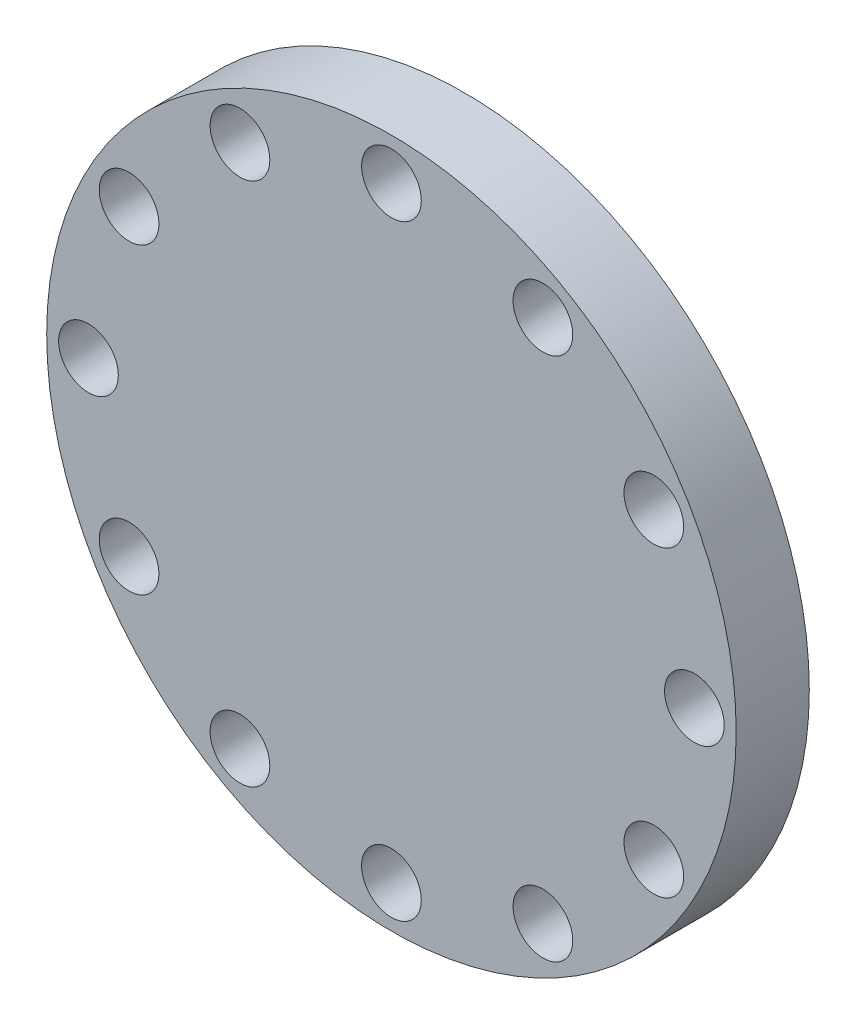
ISO-10303-21;
HEADER;
FILE_DESCRIPTION(('STEP AP214'),'2;1');
FILE_NAME('part.step','',(''),(''),'','','');
FILE_SCHEMA(('AUTOMOTIVE_DESIGN { 1 0 10303 214 1 1 1 1 }'));
ENDSEC;
DATA;
#1=APPLICATION_CONTEXT('core data for automotive mechanical design processes');
#2=APPLICATION_PROTOCOL_DEFINITION('international standard','automotive_design',2000,#1);
#3=PRODUCT_CONTEXT('',#1,'mechanical');
#4=PRODUCT('Part','Part','',(#3));
#5=PRODUCT_RELATED_PRODUCT_CATEGORY('part','',(#4));
#6=PRODUCT_DEFINITION_FORMATION('','',#4);
#7=PRODUCT_DEFINITION_CONTEXT('part definition',#1,'design');
#8=PRODUCT_DEFINITION('design','',#6,#7);
#9=PRODUCT_DEFINITION_SHAPE('','',#8);
#10=(LENGTH_UNIT() NAMED_UNIT(*) SI_UNIT(.MILLI.,.METRE.));
#11=(NAMED_UNIT(*) PLANE_ANGLE_UNIT() SI_UNIT($,.RADIAN.));
#12=(NAMED_UNIT(*) SI_UNIT($,.STERADIAN.) SOLID_ANGLE_UNIT());
#13=UNCERTAINTY_MEASURE_WITH_UNIT(LENGTH_MEASURE(1.E-05),#10,'distance_accuracy_value','');
#14=(GEOMETRIC_REPRESENTATION_CONTEXT(3) GLOBAL_UNCERTAINTY_ASSIGNED_CONTEXT((#13)) GLOBAL_UNIT_ASSIGNED_CONTEXT((#10,
#11,#12)) REPRESENTATION_CONTEXT('',''));
#15=CARTESIAN_POINT('',(0.,0.,0.));
#16=DIRECTION('',(0.,0.,1.));
#17=DIRECTION('',(1.,0.,0.));
#18=AXIS2_PLACEMENT_3D('',#15,#16,#17);
#19=CARTESIAN_POINT('',(0.,0.,70.));
#20=DIRECTION('',(0.,0.,-1.));
#21=DIRECTION('',(-1.,0.,0.));
#22=AXIS2_PLACEMENT_3D('',#19,#20,#21);
#23=CYLINDRICAL_SURFACE('',#22,330.);
#24=CARTESIAN_POINT('',(0.,0.,70.));
#25=DIRECTION('',(0.,0.,1.));
#26=DIRECTION('',(1.,0.,0.));
#27=AXIS2_PLACEMENT_3D('',#24,#25,#26);
#28=CIRCLE('',#27,330.);
#29=CARTESIAN_POINT('',(330.,0.,70.));
#30=VERTEX_POINT('',#29);
#31=EDGE_CURVE('E11',#30,#30,#28,.T.);
#32=ORIENTED_EDGE('',*,*,#31,.F.);
#33=EDGE_LOOP('',(#32));
#34=FACE_BOUND('',#33,.T.);
#35=CARTESIAN_POINT('',(0.,0.,0.));
#36=DIRECTION('',(0.,0.,1.));
#37=DIRECTION('',(1.,0.,0.));
#38=AXIS2_PLACEMENT_3D('',#35,#36,#37);
#39=CIRCLE('',#38,330.);
#40=CARTESIAN_POINT('',(330.,0.,0.));
#41=VERTEX_POINT('',#40);
#42=EDGE_CURVE('E43',#41,#41,#39,.T.);
#43=ORIENTED_EDGE('',*,*,#42,.T.);
#44=EDGE_LOOP('',(#43));
#45=FACE_BOUND('',#44,.T.);
#46=ADVANCED_FACE('F40',(#34,#45),#23,.T.);
#47=CARTESIAN_POINT('',(0.,0.,70.));
#48=DIRECTION('',(0.,0.,1.));
#49=DIRECTION('',(1.,0.,0.));
#50=AXIS2_PLACEMENT_3D('',#47,#48,#49);
#51=PLANE('',#50);
#52=CARTESIAN_POINT('',(251.147367097493,145.000000000011,70.));
#53=DIRECTION('',(0.,0.,1.));
#54=DIRECTION('',(1.,0.,0.));
#55=AXIS2_PLACEMENT_3D('',#52,#53,#54);
#56=CIRCLE('',#55,28.5750000000034);
#57=CARTESIAN_POINT('',(279.722367097497,145.000000000011,70.));
#58=VERTEX_POINT('',#57);
#59=EDGE_CURVE('E57',#58,#58,#56,.F.);
#60=ORIENTED_EDGE('',*,*,#59,.T.);
#61=EDGE_LOOP('',(#60));
#62=FACE_BOUND('',#61,.T.);
#63=CARTESIAN_POINT('',(145.,251.147367097487,70.));
#64=DIRECTION('',(0.,0.,1.));
#65=DIRECTION('',(1.,0.,0.));
#66=AXIS2_PLACEMENT_3D('',#63,#64,#65);
#67=CIRCLE('',#66,28.575);
#68=CARTESIAN_POINT('',(173.575,251.147367097487,70.));
#69=VERTEX_POINT('',#68);
#70=EDGE_CURVE('E60',#69,#69,#67,.F.);
#71=ORIENTED_EDGE('',*,*,#70,.T.);
#72=EDGE_LOOP('',(#71));
#73=FACE_BOUND('',#72,.T.);
#74=CARTESIAN_POINT('',(0.,290.,70.));
#75=DIRECTION('',(0.,0.,1.));
#76=DIRECTION('',(1.,0.,0.));
#77=AXIS2_PLACEMENT_3D('',#74,#75,#76);
#78=CIRCLE('',#77,28.575);
#79=CARTESIAN_POINT('',(28.575,290.,70.));
#80=VERTEX_POINT('',#79);
#81=EDGE_CURVE('E63',#80,#80,#78,.F.);
#82=ORIENTED_EDGE('',*,*,#81,.T.);
#83=EDGE_LOOP('',(#82));
#84=FACE_BOUND('',#83,.T.);
#85=CARTESIAN_POINT('',(-144.999999999998,251.147367097481,70.));
#86=DIRECTION('',(0.,0.,1.));
#87=DIRECTION('',(1.,0.,0.));
#88=AXIS2_PLACEMENT_3D('',#85,#86,#87);
#89=CIRCLE('',#88,28.5750000000072);
#90=CARTESIAN_POINT('',(-116.424999999991,251.147367097481,70.));
#91=VERTEX_POINT('',#90);
#92=EDGE_CURVE('E66',#91,#91,#89,.F.);
#93=ORIENTED_EDGE('',*,*,#92,.T.);
#94=EDGE_LOOP('',(#93));
#95=FACE_BOUND('',#94,.T.);
#96=CARTESIAN_POINT('',(-251.147367097481,144.999999999989,70.));
#97=DIRECTION('',(0.,0.,1.));
#98=DIRECTION('',(1.,0.,0.));
#99=AXIS2_PLACEMENT_3D('',#96,#97,#98);
#100=CIRCLE('',#99,28.5750000000125);
#101=CARTESIAN_POINT('',(-222.572367097469,144.999999999989,70.));
#102=VERTEX_POINT('',#101);
#103=EDGE_CURVE('E69',#102,#102,#100,.F.);
#104=ORIENTED_EDGE('',*,*,#103,.T.);
#105=EDGE_LOOP('',(#104));
#106=FACE_BOUND('',#105,.T.);
#107=CARTESIAN_POINT('',(145.000000000023,-251.147367097481,70.));
#108=DIRECTION('',(0.,0.,1.));
#109=DIRECTION('',(1.,0.,0.));
#110=AXIS2_PLACEMENT_3D('',#107,#108,#109);
#111=CIRCLE('',#110,28.5750000000219);
#112=CARTESIAN_POINT('',(173.575000000045,-251.147367097481,70.));
#113=VERTEX_POINT('',#112);
#114=EDGE_CURVE('E72',#113,#113,#111,.F.);
#115=ORIENTED_EDGE('',*,*,#114,.T.);
#116=EDGE_LOOP('',(#115));
#117=FACE_BOUND('',#116,.T.);
#118=CARTESIAN_POINT('',(-144.999999999977,-251.147367097493,70.));
#119=DIRECTION('',(0.,0.,1.));
#120=DIRECTION('',(1.,0.,0.));
#121=AXIS2_PLACEMENT_3D('',#118,#119,#120);
#122=CIRCLE('',#121,28.5750000000261);
#123=CARTESIAN_POINT('',(-116.424999999951,-251.147367097493,70.));
#124=VERTEX_POINT('',#123);
#125=EDGE_CURVE('E75',#124,#124,#122,.F.);
#126=ORIENTED_EDGE('',*,*,#125,.T.);
#127=EDGE_LOOP('',(#126));
#128=FACE_BOUND('',#127,.T.);
#129=CARTESIAN_POINT('',(251.147367097506,-144.999999999989,70.));
#130=DIRECTION('',(0.,0.,1.));
#131=DIRECTION('',(1.,0.,0.));
#132=AXIS2_PLACEMENT_3D('',#129,#130,#131);
#133=CIRCLE('',#132,28.5750000000159);
#134=CARTESIAN_POINT('',(279.722367097522,-144.999999999989,70.));
#135=VERTEX_POINT('',#134);
#136=EDGE_CURVE('E78',#135,#135,#133,.F.);
#137=ORIENTED_EDGE('',*,*,#136,.T.);
#138=EDGE_LOOP('',(#137));
#139=FACE_BOUND('',#138,.T.);
#140=CARTESIAN_POINT('',(2.46558576901009E-11,-290.,70.));
#141=DIRECTION('',(0.,0.,1.));
#142=DIRECTION('',(1.,0.,0.));
#143=AXIS2_PLACEMENT_3D('',#140,#141,#142);
#144=CIRCLE('',#143,28.5750000000255);
#145=CARTESIAN_POINT('',(28.5750000000502,-290.,70.));
#146=VERTEX_POINT('',#145);
#147=EDGE_CURVE('E81',#146,#146,#144,.F.);
#148=ORIENTED_EDGE('',*,*,#147,.T.);
#149=EDGE_LOOP('',(#148));
#150=FACE_BOUND('',#149,.T.);
#151=CARTESIAN_POINT('',(-251.147367097469,-145.000000000011,70.));
#152=DIRECTION('',(0.,0.,1.));
#153=DIRECTION('',(1.,0.,0.));
#154=AXIS2_PLACEMENT_3D('',#151,#152,#153);
#155=CIRCLE('',#154,28.5750000000236);
#156=CARTESIAN_POINT('',(-222.572367097445,-145.000000000011,70.));
#157=VERTEX_POINT('',#156);
#158=EDGE_CURVE('E84',#157,#157,#155,.F.);
#159=ORIENTED_EDGE('',*,*,#158,.T.);
#160=EDGE_LOOP('',(#159));
#161=FACE_BOUND('',#160,.T.);
#162=CARTESIAN_POINT('',(-289.999999999988,-1.23634436022257E-11,70.));
#163=DIRECTION('',(0.,0.,1.));
#164=DIRECTION('',(1.,0.,0.));
#165=AXIS2_PLACEMENT_3D('',#162,#163,#164);
#166=CIRCLE('',#165,28.5750000000184);
#167=CARTESIAN_POINT('',(-261.424999999969,-1.23634436022257E-11,70.));
#168=VERTEX_POINT('',#167);
#169=EDGE_CURVE('E87',#168,#168,#166,.F.);
#170=ORIENTED_EDGE('',*,*,#169,.T.);
#171=EDGE_LOOP('',(#170));
#172=FACE_BOUND('',#171,.T.);
#173=CARTESIAN_POINT('',(290.000000000012,1.23279288450505E-11,70.));
#174=DIRECTION('',(0.,0.,1.));
#175=DIRECTION('',(1.,0.,0.));
#176=AXIS2_PLACEMENT_3D('',#173,#174,#175);
#177=CIRCLE('',#176,28.5750000000092);
#178=CARTESIAN_POINT('',(318.575000000021,1.23279288450505E-11,70.));
#179=VERTEX_POINT('',#178);
#180=EDGE_CURVE('E50',#179,#179,#177,.F.);
#181=ORIENTED_EDGE('',*,*,#180,.T.);
#182=EDGE_LOOP('',(#181));
#183=FACE_BOUND('',#182,.T.);
#184=ORIENTED_EDGE('',*,*,#31,.T.);
#185=EDGE_LOOP('',(#184));
#186=FACE_BOUND('',#185,.T.);
#187=ADVANCED_FACE('F140',(#62,#73,#84,#95,#106,#117,#128,#139,#150,#161,#172,#183,#186),#51,.T.);
#188=CARTESIAN_POINT('',(0.,0.,0.));
#189=DIRECTION('',(0.,0.,1.));
#190=DIRECTION('',(1.,0.,0.));
#191=AXIS2_PLACEMENT_3D('',#188,#189,#190);
#192=PLANE('',#191);
#193=CARTESIAN_POINT('',(251.147367097493,145.000000000011,0.));
#194=DIRECTION('',(0.,0.,1.));
#195=DIRECTION('',(1.,0.,0.));
#196=AXIS2_PLACEMENT_3D('',#193,#194,#195);
#197=CIRCLE('',#196,28.5750000000034);
#198=CARTESIAN_POINT('',(279.722367097497,145.000000000011,0.));
#199=VERTEX_POINT('',#198);
#200=EDGE_CURVE('E90',#199,#199,#197,.T.);
#201=ORIENTED_EDGE('',*,*,#200,.T.);
#202=EDGE_LOOP('',(#201));
#203=FACE_BOUND('',#202,.T.);
#204=CARTESIAN_POINT('',(145.,251.147367097487,0.));
#205=DIRECTION('',(0.,0.,1.));
#206=DIRECTION('',(1.,0.,0.));
#207=AXIS2_PLACEMENT_3D('',#204,#205,#206);
#208=CIRCLE('',#207,28.575);
#209=CARTESIAN_POINT('',(173.575,251.147367097487,0.));
#210=VERTEX_POINT('',#209);
#211=EDGE_CURVE('E118',#210,#210,#208,.T.);
#212=ORIENTED_EDGE('',*,*,#211,.T.);
#213=EDGE_LOOP('',(#212));
#214=FACE_BOUND('',#213,.T.);
#215=CARTESIAN_POINT('',(0.,290.,0.));
#216=DIRECTION('',(0.,0.,1.));
#217=DIRECTION('',(1.,0.,0.));
#218=AXIS2_PLACEMENT_3D('',#215,#216,#217);
#219=CIRCLE('',#218,28.575);
#220=CARTESIAN_POINT('',(28.575,290.,0.));
#221=VERTEX_POINT('',#220);
#222=EDGE_CURVE('E115',#221,#221,#219,.T.);
#223=ORIENTED_EDGE('',*,*,#222,.T.);
#224=EDGE_LOOP('',(#223));
#225=FACE_BOUND('',#224,.T.);
#226=CARTESIAN_POINT('',(-144.999999999998,251.147367097481,0.));
#227=DIRECTION('',(0.,0.,1.));
#228=DIRECTION('',(1.,0.,0.));
#229=AXIS2_PLACEMENT_3D('',#226,#227,#228);
#230=CIRCLE('',#229,28.5750000000072);
#231=CARTESIAN_POINT('',(-116.424999999991,251.147367097481,0.));
#232=VERTEX_POINT('',#231);
#233=EDGE_CURVE('E112',#232,#232,#230,.T.);
#234=ORIENTED_EDGE('',*,*,#233,.T.);
#235=EDGE_LOOP('',(#234));
#236=FACE_BOUND('',#235,.T.);
#237=CARTESIAN_POINT('',(-251.147367097481,144.999999999989,0.));
#238=DIRECTION('',(0.,0.,1.));
#239=DIRECTION('',(1.,0.,0.));
#240=AXIS2_PLACEMENT_3D('',#237,#238,#239);
#241=CIRCLE('',#240,28.5750000000125);
#242=CARTESIAN_POINT('',(-222.572367097469,144.999999999989,0.));
#243=VERTEX_POINT('',#242);
#244=EDGE_CURVE('E101',#243,#243,#241,.T.);
#245=ORIENTED_EDGE('',*,*,#244,.T.);
#246=EDGE_LOOP('',(#245));
#247=FACE_BOUND('',#246,.T.);
#248=CARTESIAN_POINT('',(145.000000000023,-251.147367097481,0.));
#249=DIRECTION('',(0.,0.,1.));
#250=DIRECTION('',(1.,0.,0.));
#251=AXIS2_PLACEMENT_3D('',#248,#249,#250);
#252=CIRCLE('',#251,28.5750000000219);
#253=CARTESIAN_POINT('',(173.575000000045,-251.147367097481,0.));
#254=VERTEX_POINT('',#253);
#255=EDGE_CURVE('E102',#254,#254,#252,.T.);
#256=ORIENTED_EDGE('',*,*,#255,.T.);
#257=EDGE_LOOP('',(#256));
#258=FACE_BOUND('',#257,.T.);
#259=CARTESIAN_POINT('',(-144.999999999977,-251.147367097493,0.));
#260=DIRECTION('',(0.,0.,1.));
#261=DIRECTION('',(1.,0.,0.));
#262=AXIS2_PLACEMENT_3D('',#259,#260,#261);
#263=CIRCLE('',#262,28.5750000000261);
#264=CARTESIAN_POINT('',(-116.424999999951,-251.147367097493,0.));
#265=VERTEX_POINT('',#264);
#266=EDGE_CURVE('E105',#265,#265,#263,.T.);
#267=ORIENTED_EDGE('',*,*,#266,.T.);
#268=EDGE_LOOP('',(#267));
#269=FACE_BOUND('',#268,.T.);
#270=CARTESIAN_POINT('',(251.147367097506,-144.999999999989,0.));
#271=DIRECTION('',(0.,0.,1.));
#272=DIRECTION('',(1.,0.,0.));
#273=AXIS2_PLACEMENT_3D('',#270,#271,#272);
#274=CIRCLE('',#273,28.5750000000159);
#275=CARTESIAN_POINT('',(279.722367097522,-144.999999999989,0.));
#276=VERTEX_POINT('',#275);
#277=EDGE_CURVE('E95',#276,#276,#274,.T.);
#278=ORIENTED_EDGE('',*,*,#277,.T.);
#279=EDGE_LOOP('',(#278));
#280=FACE_BOUND('',#279,.T.);
#281=CARTESIAN_POINT('',(2.46558576901009E-11,-290.,0.));
#282=DIRECTION('',(0.,0.,1.));
#283=DIRECTION('',(1.,0.,0.));
#284=AXIS2_PLACEMENT_3D('',#281,#282,#283);
#285=CIRCLE('',#284,28.5750000000255);
#286=CARTESIAN_POINT('',(28.5750000000502,-290.,0.));
#287=VERTEX_POINT('',#286);
#288=EDGE_CURVE('E91',#287,#287,#285,.T.);
#289=ORIENTED_EDGE('',*,*,#288,.T.);
#290=EDGE_LOOP('',(#289));
#291=FACE_BOUND('',#290,.T.);
#292=CARTESIAN_POINT('',(-251.147367097469,-145.000000000011,0.));
#293=DIRECTION('',(0.,0.,1.));
#294=DIRECTION('',(1.,0.,0.));
#295=AXIS2_PLACEMENT_3D('',#292,#293,#294);
#296=CIRCLE('',#295,28.5750000000236);
#297=CARTESIAN_POINT('',(-222.572367097445,-145.000000000011,0.));
#298=VERTEX_POINT('',#297);
#299=EDGE_CURVE('E94',#298,#298,#296,.T.);
#300=ORIENTED_EDGE('',*,*,#299,.T.);
#301=EDGE_LOOP('',(#300));
#302=FACE_BOUND('',#301,.T.);
#303=CARTESIAN_POINT('',(-289.999999999988,-1.23634436022257E-11,0.));
#304=DIRECTION('',(0.,0.,1.));
#305=DIRECTION('',(1.,0.,0.));
#306=AXIS2_PLACEMENT_3D('',#303,#304,#305);
#307=CIRCLE('',#306,28.5750000000184);
#308=CARTESIAN_POINT('',(-261.424999999969,-1.23634436022257E-11,0.));
#309=VERTEX_POINT('',#308);
#310=EDGE_CURVE('E98',#309,#309,#307,.T.);
#311=ORIENTED_EDGE('',*,*,#310,.T.);
#312=EDGE_LOOP('',(#311));
#313=FACE_BOUND('',#312,.T.);
#314=CARTESIAN_POINT('',(290.000000000012,1.23279288450505E-11,0.));
#315=DIRECTION('',(0.,0.,1.));
#316=DIRECTION('',(1.,0.,0.));
#317=AXIS2_PLACEMENT_3D('',#314,#315,#316);
#318=CIRCLE('',#317,28.5750000000092);
#319=CARTESIAN_POINT('',(318.575000000021,1.23279288450505E-11,0.));
#320=VERTEX_POINT('',#319);
#321=EDGE_CURVE('E54',#320,#320,#318,.T.);
#322=ORIENTED_EDGE('',*,*,#321,.T.);
#323=EDGE_LOOP('',(#322));
#324=FACE_BOUND('',#323,.T.);
#325=ORIENTED_EDGE('',*,*,#42,.F.);
#326=EDGE_LOOP('',(#325));
#327=FACE_BOUND('',#326,.T.);
#328=ADVANCED_FACE('F124',(#203,#214,#225,#236,#247,#258,#269,#280,#291,#302,#313,#324,#327),
#192,.F.);
#329=CARTESIAN_POINT('',(290.000000000012,1.23279288450505E-11,131.));
#330=DIRECTION('',(0.,0.,-1.));
#331=DIRECTION('',(-1.,0.,0.));
#332=AXIS2_PLACEMENT_3D('',#329,#330,#331);
#333=CYLINDRICAL_SURFACE('',#332,28.5750000000092);
#334=ORIENTED_EDGE('',*,*,#180,.F.);
#335=EDGE_LOOP('',(#334));
#336=FACE_BOUND('',#335,.T.);
#337=ORIENTED_EDGE('',*,*,#321,.F.);
#338=EDGE_LOOP('',(#337));
#339=FACE_BOUND('',#338,.T.);
#340=ADVANCED_FACE('F151',(#336,#339),#333,.F.);
#341=CARTESIAN_POINT('',(-289.999999999988,-1.23634436022257E-11,131.));
#342=DIRECTION('',(0.,0.,-1.));
#343=DIRECTION('',(-1.,0.,0.));
#344=AXIS2_PLACEMENT_3D('',#341,#342,#343);
#345=CYLINDRICAL_SURFACE('',#344,28.5750000000184);
#346=ORIENTED_EDGE('',*,*,#169,.F.);
#347=EDGE_LOOP('',(#346));
#348=FACE_BOUND('',#347,.T.);
#349=ORIENTED_EDGE('',*,*,#310,.F.);
#350=EDGE_LOOP('',(#349));
#351=FACE_BOUND('',#350,.T.);
#352=ADVANCED_FACE('F155',(#348,#351),#345,.F.);
#353=CARTESIAN_POINT('',(-251.147367097469,-145.000000000011,131.));
#354=DIRECTION('',(0.,0.,-1.));
#355=DIRECTION('',(-1.,0.,0.));
#356=AXIS2_PLACEMENT_3D('',#353,#354,#355);
#357=CYLINDRICAL_SURFACE('',#356,28.5750000000236);
#358=ORIENTED_EDGE('',*,*,#158,.F.);
#359=EDGE_LOOP('',(#358));
#360=FACE_BOUND('',#359,.T.);
#361=ORIENTED_EDGE('',*,*,#299,.F.);
#362=EDGE_LOOP('',(#361));
#363=FACE_BOUND('',#362,.T.);
#364=ADVANCED_FACE('F163',(#360,#363),#357,.F.);
#365=CARTESIAN_POINT('',(2.46558576901009E-11,-290.,131.));
#366=DIRECTION('',(0.,0.,-1.));
#367=DIRECTION('',(-1.,0.,0.));
#368=AXIS2_PLACEMENT_3D('',#365,#366,#367);
#369=CYLINDRICAL_SURFACE('',#368,28.5750000000255);
#370=ORIENTED_EDGE('',*,*,#147,.F.);
#371=EDGE_LOOP('',(#370));
#372=FACE_BOUND('',#371,.T.);
#373=ORIENTED_EDGE('',*,*,#288,.F.);
#374=EDGE_LOOP('',(#373));
#375=FACE_BOUND('',#374,.T.);
#376=ADVANCED_FACE('F159',(#372,#375),#369,.F.);
#377=CARTESIAN_POINT('',(251.147367097506,-144.999999999989,131.));
#378=DIRECTION('',(0.,0.,-1.));
#379=DIRECTION('',(-1.,0.,0.));
#380=AXIS2_PLACEMENT_3D('',#377,#378,#379);
#381=CYLINDRICAL_SURFACE('',#380,28.5750000000159);
#382=ORIENTED_EDGE('',*,*,#136,.F.);
#383=EDGE_LOOP('',(#382));
#384=FACE_BOUND('',#383,.T.);
#385=ORIENTED_EDGE('',*,*,#277,.F.);
#386=EDGE_LOOP('',(#385));
#387=FACE_BOUND('',#386,.T.);
#388=ADVANCED_FACE('F162',(#384,#387),#381,.F.);
#389=CARTESIAN_POINT('',(-144.999999999977,-251.147367097493,131.));
#390=DIRECTION('',(0.,0.,-1.));
#391=DIRECTION('',(-1.,0.,0.));
#392=AXIS2_PLACEMENT_3D('',#389,#390,#391);
#393=CYLINDRICAL_SURFACE('',#392,28.5750000000261);
#394=ORIENTED_EDGE('',*,*,#125,.F.);
#395=EDGE_LOOP('',(#394));
#396=FACE_BOUND('',#395,.T.);
#397=ORIENTED_EDGE('',*,*,#266,.F.);
#398=EDGE_LOOP('',(#397));
#399=FACE_BOUND('',#398,.T.);
#400=ADVANCED_FACE('F175',(#396,#399),#393,.F.);
#401=CARTESIAN_POINT('',(145.000000000023,-251.147367097481,131.));
#402=DIRECTION('',(0.,0.,-1.));
#403=DIRECTION('',(-1.,0.,0.));
#404=AXIS2_PLACEMENT_3D('',#401,#402,#403);
#405=CYLINDRICAL_SURFACE('',#404,28.5750000000219);
#406=ORIENTED_EDGE('',*,*,#114,.F.);
#407=EDGE_LOOP('',(#406));
#408=FACE_BOUND('',#407,.T.);
#409=ORIENTED_EDGE('',*,*,#255,.F.);
#410=EDGE_LOOP('',(#409));
#411=FACE_BOUND('',#410,.T.);
#412=ADVANCED_FACE('F171',(#408,#411),#405,.F.);
#413=CARTESIAN_POINT('',(-251.147367097481,144.999999999989,131.));
#414=DIRECTION('',(0.,0.,-1.));
#415=DIRECTION('',(-1.,0.,0.));
#416=AXIS2_PLACEMENT_3D('',#413,#414,#415);
#417=CYLINDRICAL_SURFACE('',#416,28.5750000000125);
#418=ORIENTED_EDGE('',*,*,#103,.F.);
#419=EDGE_LOOP('',(#418));
#420=FACE_BOUND('',#419,.T.);
#421=ORIENTED_EDGE('',*,*,#244,.F.);
#422=EDGE_LOOP('',(#421));
#423=FACE_BOUND('',#422,.T.);
#424=ADVANCED_FACE('F174',(#420,#423),#417,.F.);
#425=CARTESIAN_POINT('',(-144.999999999998,251.147367097481,131.));
#426=DIRECTION('',(0.,0.,-1.));
#427=DIRECTION('',(-1.,0.,0.));
#428=AXIS2_PLACEMENT_3D('',#425,#426,#427);
#429=CYLINDRICAL_SURFACE('',#428,28.5750000000072);
#430=ORIENTED_EDGE('',*,*,#92,.F.);
#431=EDGE_LOOP('',(#430));
#432=FACE_BOUND('',#431,.T.);
#433=ORIENTED_EDGE('',*,*,#233,.F.);
#434=EDGE_LOOP('',(#433));
#435=FACE_BOUND('',#434,.T.);
#436=ADVANCED_FACE('F185',(#432,#435),#429,.F.);
#437=CARTESIAN_POINT('',(0.,290.,131.));
#438=DIRECTION('',(0.,0.,-1.));
#439=DIRECTION('',(-1.,0.,0.));
#440=AXIS2_PLACEMENT_3D('',#437,#438,#439);
#441=CYLINDRICAL_SURFACE('',#440,28.575);
#442=ORIENTED_EDGE('',*,*,#81,.F.);
#443=EDGE_LOOP('',(#442));
#444=FACE_BOUND('',#443,.T.);
#445=ORIENTED_EDGE('',*,*,#222,.F.);
#446=EDGE_LOOP('',(#445));
#447=FACE_BOUND('',#446,.T.);
#448=ADVANCED_FACE('F135',(#444,#447),#441,.F.);
#449=CARTESIAN_POINT('',(145.,251.147367097487,131.));
#450=DIRECTION('',(0.,0.,-1.));
#451=DIRECTION('',(-1.,0.,0.));
#452=AXIS2_PLACEMENT_3D('',#449,#450,#451);
#453=CYLINDRICAL_SURFACE('',#452,28.575);
#454=ORIENTED_EDGE('',*,*,#70,.F.);
#455=EDGE_LOOP('',(#454));
#456=FACE_BOUND('',#455,.T.);
#457=ORIENTED_EDGE('',*,*,#211,.F.);
#458=EDGE_LOOP('',(#457));
#459=FACE_BOUND('',#458,.T.);
#460=ADVANCED_FACE('F129',(#456,#459),#453,.F.);
#461=CARTESIAN_POINT('',(251.147367097493,145.000000000011,131.));
#462=DIRECTION('',(0.,0.,-1.));
#463=DIRECTION('',(-1.,0.,0.));
#464=AXIS2_PLACEMENT_3D('',#461,#462,#463);
#465=CYLINDRICAL_SURFACE('',#464,28.5750000000034);
#466=ORIENTED_EDGE('',*,*,#59,.F.);
#467=EDGE_LOOP('',(#466));
#468=FACE_BOUND('',#467,.T.);
#469=ORIENTED_EDGE('',*,*,#200,.F.);
#470=EDGE_LOOP('',(#469));
#471=FACE_BOUND('',#470,.T.);
#472=ADVANCED_FACE('F127',(#468,#471),#465,.F.);
#473=CLOSED_SHELL('',(#46,#187,#328,#340,#352,#364,#376,#388,#400,#412,#424,#436,#448,#460,#472));
#474=MANIFOLD_SOLID_BREP('B2',#473);
#475=ADVANCED_BREP_SHAPE_REPRESENTATION('',(#18,#474),#14);
#476=SHAPE_DEFINITION_REPRESENTATION(#9,#475);
ENDSEC;
END-ISO-10303-21;
